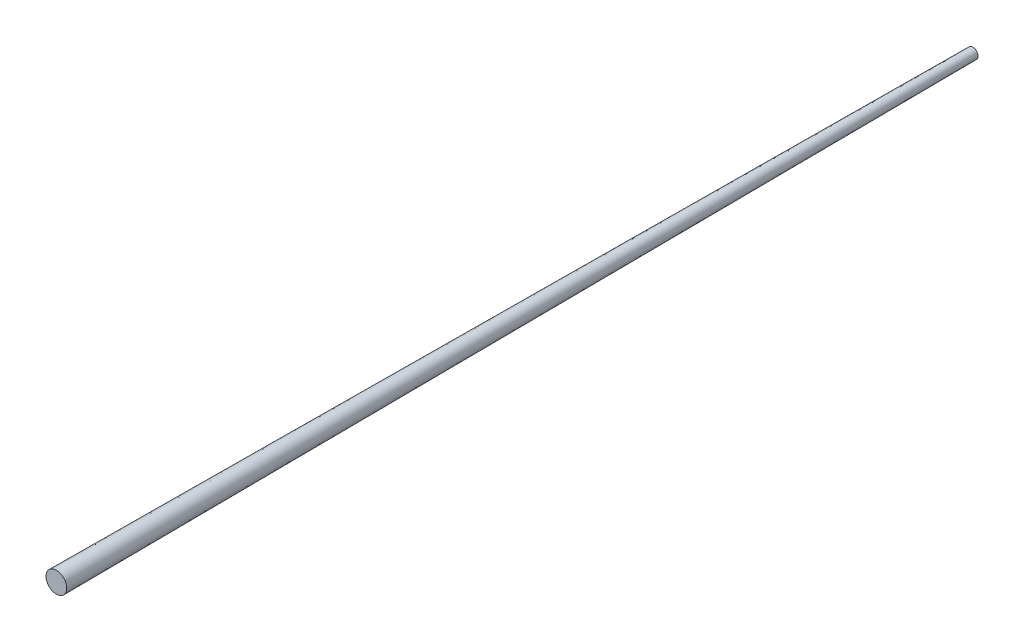
ISO-10303-21;
HEADER;
FILE_DESCRIPTION(('STEP AP214'),'2;1');
FILE_NAME('part.step','',(''),(''),'','','');
FILE_SCHEMA(('AUTOMOTIVE_DESIGN { 1 0 10303 214 1 1 1 1 }'));
ENDSEC;
DATA;
#1=APPLICATION_CONTEXT('core data for automotive mechanical design processes');
#2=APPLICATION_PROTOCOL_DEFINITION('international standard','automotive_design',2000,#1);
#3=PRODUCT_CONTEXT('',#1,'mechanical');
#4=PRODUCT('Part','Part','',(#3));
#5=PRODUCT_RELATED_PRODUCT_CATEGORY('part','',(#4));
#6=PRODUCT_DEFINITION_FORMATION('','',#4);
#7=PRODUCT_DEFINITION_CONTEXT('part definition',#1,'design');
#8=PRODUCT_DEFINITION('design','',#6,#7);
#9=PRODUCT_DEFINITION_SHAPE('','',#8);
#10=(LENGTH_UNIT() NAMED_UNIT(*) SI_UNIT(.MILLI.,.METRE.));
#11=(NAMED_UNIT(*) PLANE_ANGLE_UNIT() SI_UNIT($,.RADIAN.));
#12=(NAMED_UNIT(*) SI_UNIT($,.STERADIAN.) SOLID_ANGLE_UNIT());
#13=UNCERTAINTY_MEASURE_WITH_UNIT(LENGTH_MEASURE(1.E-05),#10,'distance_accuracy_value','');
#14=(GEOMETRIC_REPRESENTATION_CONTEXT(3) GLOBAL_UNCERTAINTY_ASSIGNED_CONTEXT((#13)) GLOBAL_UNIT_ASSIGNED_CONTEXT((#10,
#11,#12)) REPRESENTATION_CONTEXT('',''));
#15=CARTESIAN_POINT('',(0.,0.,0.));
#16=DIRECTION('',(0.,0.,1.));
#17=DIRECTION('',(1.,0.,0.));
#18=AXIS2_PLACEMENT_3D('',#15,#16,#17);
#19=CARTESIAN_POINT('',(0.,0.,-355.6));
#20=DIRECTION('',(0.,0.,1.));
#21=DIRECTION('',(1.,0.,0.));
#22=AXIS2_PLACEMENT_3D('',#19,#20,#21);
#23=PLANE('',#22);
#24=CARTESIAN_POINT('',(0.,0.,-355.6));
#25=DIRECTION('',(0.,0.,-1.));
#26=DIRECTION('',(-1.,0.,0.));
#27=AXIS2_PLACEMENT_3D('',#24,#25,#26);
#28=CIRCLE('',#27,2.02);
#29=CARTESIAN_POINT('',(-2.02,0.,-355.6));
#30=VERTEX_POINT('',#29);
#31=EDGE_CURVE('E39',#30,#30,#28,.T.);
#32=ORIENTED_EDGE('',*,*,#31,.T.);
#33=EDGE_LOOP('',(#32));
#34=FACE_BOUND('',#33,.T.);
#35=ADVANCED_FACE('F33',(#34),#23,.F.);
#36=CARTESIAN_POINT('',(0.,0.,0.));
#37=DIRECTION('',(0.,0.,-1.));
#38=DIRECTION('',(-1.,0.,0.));
#39=AXIS2_PLACEMENT_3D('',#36,#37,#38);
#40=PLANE('',#39);
#41=CARTESIAN_POINT('',(0.,0.,0.));
#42=DIRECTION('',(0.,0.,-1.));
#43=DIRECTION('',(-1.,0.,0.));
#44=AXIS2_PLACEMENT_3D('',#41,#42,#43);
#45=CIRCLE('',#44,4.02);
#46=CARTESIAN_POINT('',(-4.02,0.,0.));
#47=VERTEX_POINT('',#46);
#48=EDGE_CURVE('E10',#47,#47,#45,.T.);
#49=ORIENTED_EDGE('',*,*,#48,.F.);
#50=EDGE_LOOP('',(#49));
#51=FACE_BOUND('',#50,.T.);
#52=ADVANCED_FACE('F48',(#51),#40,.F.);
#53=CARTESIAN_POINT('',(0.,0.,0.));
#54=DIRECTION('',(0.,0.,1.));
#55=DIRECTION('',(1.,0.,0.));
#56=AXIS2_PLACEMENT_3D('',#53,#54,#55);
#57=CONICAL_SURFACE('',#56,4.02,0.00562423766007506);
#58=ORIENTED_EDGE('',*,*,#31,.F.);
#59=EDGE_LOOP('',(#58));
#60=FACE_BOUND('',#59,.T.);
#61=ORIENTED_EDGE('',*,*,#48,.T.);
#62=EDGE_LOOP('',(#61));
#63=FACE_BOUND('',#62,.T.);
#64=ADVANCED_FACE('F46',(#60,#63),#57,.T.);
#65=CLOSED_SHELL('',(#35,#52,#64));
#66=MANIFOLD_SOLID_BREP('B2',#65);
#67=ADVANCED_BREP_SHAPE_REPRESENTATION('',(#18,#66),#14);
#68=SHAPE_DEFINITION_REPRESENTATION(#9,#67);
ENDSEC;
END-ISO-10303-21;
